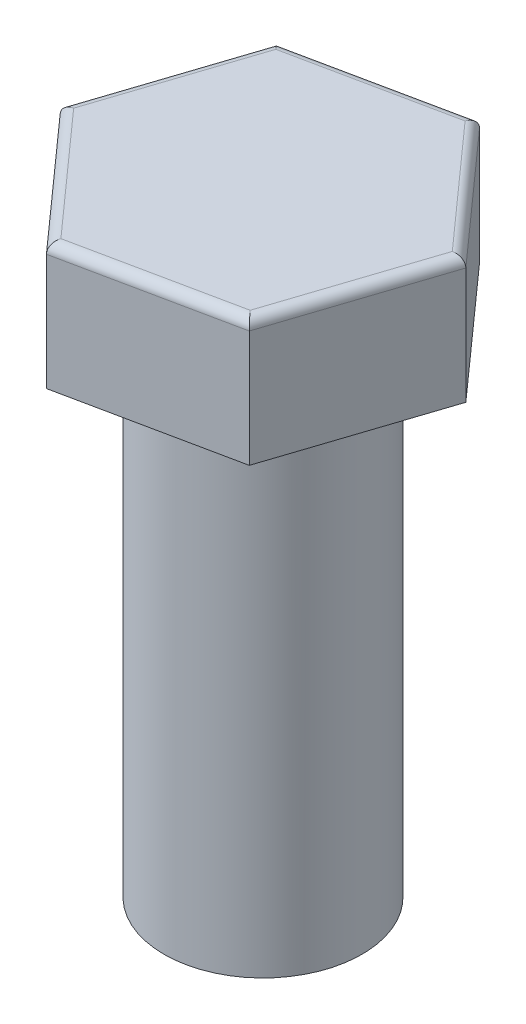
ISO-10303-21;
HEADER;
FILE_DESCRIPTION(('STEP AP214'),'2;1');
FILE_NAME('part.step','',(''),(''),'','','');
FILE_SCHEMA(('AUTOMOTIVE_DESIGN { 1 0 10303 214 1 1 1 1 }'));
ENDSEC;
DATA;
#1=APPLICATION_CONTEXT('core data for automotive mechanical design processes');
#2=APPLICATION_PROTOCOL_DEFINITION('international standard','automotive_design',2000,#1);
#3=PRODUCT_CONTEXT('',#1,'mechanical');
#4=PRODUCT('Part','Part','',(#3));
#5=PRODUCT_RELATED_PRODUCT_CATEGORY('part','',(#4));
#6=PRODUCT_DEFINITION_FORMATION('','',#4);
#7=PRODUCT_DEFINITION_CONTEXT('part definition',#1,'design');
#8=PRODUCT_DEFINITION('design','',#6,#7);
#9=PRODUCT_DEFINITION_SHAPE('','',#8);
#10=(LENGTH_UNIT() NAMED_UNIT(*) SI_UNIT(.MILLI.,.METRE.));
#11=(NAMED_UNIT(*) PLANE_ANGLE_UNIT() SI_UNIT($,.RADIAN.));
#12=(NAMED_UNIT(*) SI_UNIT($,.STERADIAN.) SOLID_ANGLE_UNIT());
#13=UNCERTAINTY_MEASURE_WITH_UNIT(LENGTH_MEASURE(1.E-05),#10,'distance_accuracy_value','');
#14=(GEOMETRIC_REPRESENTATION_CONTEXT(3) GLOBAL_UNCERTAINTY_ASSIGNED_CONTEXT((#13)) GLOBAL_UNIT_ASSIGNED_CONTEXT((#10,
#11,#12)) REPRESENTATION_CONTEXT('',''));
#15=CARTESIAN_POINT('',(0.,0.,0.));
#16=DIRECTION('',(0.,0.,1.));
#17=DIRECTION('',(1.,0.,0.));
#18=AXIS2_PLACEMENT_3D('',#15,#16,#17);
#19=CARTESIAN_POINT('',(6.9214389065101,0.,7.75201157529116));
#20=DIRECTION('',(0.,1.,0.));
#21=DIRECTION('',(0.,0.,1.));
#22=AXIS2_PLACEMENT_3D('',#19,#20,#21);
#23=PLANE('',#22);
#24=DIRECTION('',(0.979008849262027,0.,-0.203817744729554));
#25=VECTOR('',#24,1.);
#26=CARTESIAN_POINT('',(-3.25271950137811,0.,9.8701477114253));
#27=LINE('',#26,#25);
#28=CARTESIAN_POINT('',(-3.25271950137811,0.,9.8701477114253));
#29=VERTEX_POINT('',#28);
#30=CARTESIAN_POINT('',(6.9214389065101,0.,7.75201157529116));
#31=VERTEX_POINT('',#30);
#32=EDGE_CURVE('E122',#29,#31,#27,.T.);
#33=ORIENTED_EDGE('',*,*,#32,.F.);
#34=DIRECTION('',(0.666015769308859,0.,0.745937661625908));
#35=VECTOR('',#34,1.);
#36=CARTESIAN_POINT('',(-10.1741584078882,0.,2.11813613613414));
#37=LINE('',#36,#35);
#38=CARTESIAN_POINT('',(-10.1741584078882,0.,2.11813613613414));
#39=VERTEX_POINT('',#38);
#40=EDGE_CURVE('E142',#39,#29,#37,.T.);
#41=ORIENTED_EDGE('',*,*,#40,.F.);
#42=DIRECTION('',(-0.312993079953168,0.,0.949755406355463));
#43=VECTOR('',#42,1.);
#44=CARTESIAN_POINT('',(-6.92143890651008,0.,-7.75201157529115));
#45=LINE('',#44,#43);
#46=CARTESIAN_POINT('',(-6.92143890651008,0.,-7.75201157529115));
#47=VERTEX_POINT('',#46);
#48=EDGE_CURVE('E139',#47,#39,#45,.T.);
#49=ORIENTED_EDGE('',*,*,#48,.F.);
#50=DIRECTION('',(-0.979008849262027,0.,0.203817744729554));
#51=VECTOR('',#50,1.);
#52=CARTESIAN_POINT('',(3.25271950137813,0.,-9.8701477114253));
#53=LINE('',#52,#51);
#54=CARTESIAN_POINT('',(3.25271950137813,0.,-9.8701477114253));
#55=VERTEX_POINT('',#54);
#56=EDGE_CURVE('E136',#55,#47,#53,.T.);
#57=ORIENTED_EDGE('',*,*,#56,.F.);
#58=DIRECTION('',(-0.666015769308859,0.,-0.745937661625908));
#59=VECTOR('',#58,1.);
#60=CARTESIAN_POINT('',(10.1741584078882,0.,-2.11813613613415));
#61=LINE('',#60,#59);
#62=CARTESIAN_POINT('',(10.1741584078882,0.,-2.11813613613415));
#63=VERTEX_POINT('',#62);
#64=EDGE_CURVE('E125',#63,#55,#61,.T.);
#65=ORIENTED_EDGE('',*,*,#64,.F.);
#66=DIRECTION('',(0.312993079953167,0.,-0.949755406355463));
#67=VECTOR('',#66,1.);
#68=CARTESIAN_POINT('',(6.9214389065101,0.,7.75201157529116));
#69=LINE('',#68,#67);
#70=EDGE_CURVE('E110',#31,#63,#69,.T.);
#71=ORIENTED_EDGE('',*,*,#70,.F.);
#72=EDGE_LOOP('',(#33,#41,#49,#57,#65,#71));
#73=FACE_BOUND('',#72,.T.);
#74=CARTESIAN_POINT('',(0.,0.,0.));
#75=DIRECTION('',(0.,1.,0.));
#76=DIRECTION('',(0.,0.,1.));
#77=AXIS2_PLACEMENT_3D('',#74,#75,#76);
#78=CIRCLE('',#77,6.);
#79=CARTESIAN_POINT('',(0.,0.,6.));
#80=VERTEX_POINT('',#79);
#81=EDGE_CURVE('E115',#80,#80,#78,.F.);
#82=ORIENTED_EDGE('',*,*,#81,.F.);
#83=EDGE_LOOP('',(#82));
#84=FACE_BOUND('',#83,.T.);
#85=ADVANCED_FACE('F35',(#73,#84),#23,.F.);
#86=CARTESIAN_POINT('',(-3.25271950137811,7.65,9.8701477114253));
#87=DIRECTION('',(-0.203817744729554,0.,-0.979008849262027));
#88=DIRECTION('',(-0.979008849262027,0.,0.203817744729554));
#89=AXIS2_PLACEMENT_3D('',#86,#87,#88);
#90=PLANE('',#89);
#91=DIRECTION('',(0.,-1.,0.));
#92=VECTOR('',#91,1.);
#93=CARTESIAN_POINT('',(6.9214389065101,7.65,7.75201157529116));
#94=LINE('',#93,#92);
#95=CARTESIAN_POINT('',(6.9214389065101,7.05,7.75201157529116));
#96=VERTEX_POINT('',#95);
#97=EDGE_CURVE('E106',#96,#31,#94,.T.);
#98=ORIENTED_EDGE('',*,*,#97,.F.);
#99=DIRECTION('',(0.979008849262027,0.,-0.203817744729554));
#100=VECTOR('',#99,1.);
#101=CARTESIAN_POINT('',(-3.25271950137811,7.05,9.8701477114253));
#102=LINE('',#101,#100);
#103=CARTESIAN_POINT('',(-3.25271950137811,7.05,9.8701477114253));
#104=VERTEX_POINT('',#103);
#105=EDGE_CURVE('E59',#96,#104,#102,.F.);
#106=ORIENTED_EDGE('',*,*,#105,.T.);
#107=DIRECTION('',(0.,-1.,0.));
#108=VECTOR('',#107,1.);
#109=CARTESIAN_POINT('',(-3.25271950137811,7.65,9.8701477114253));
#110=LINE('',#109,#108);
#111=EDGE_CURVE('E128',#104,#29,#110,.T.);
#112=ORIENTED_EDGE('',*,*,#111,.T.);
#113=ORIENTED_EDGE('',*,*,#32,.T.);
#114=EDGE_LOOP('',(#98,#106,#112,#113));
#115=FACE_BOUND('',#114,.T.);
#116=ADVANCED_FACE('F127',(#115),#90,.F.);
#117=CARTESIAN_POINT('',(6.9214389065101,7.65,7.75201157529116));
#118=DIRECTION('',(-0.949755406355463,0.,-0.312993079953167));
#119=DIRECTION('',(-0.312993079953167,0.,0.949755406355463));
#120=AXIS2_PLACEMENT_3D('',#117,#118,#119);
#121=PLANE('',#120);
#122=DIRECTION('',(0.,-1.,0.));
#123=VECTOR('',#122,1.);
#124=CARTESIAN_POINT('',(10.1741584078882,7.65,-2.11813613613415));
#125=LINE('',#124,#123);
#126=CARTESIAN_POINT('',(10.1741584078882,7.05,-2.11813613613415));
#127=VERTEX_POINT('',#126);
#128=EDGE_CURVE('E116',#127,#63,#125,.T.);
#129=ORIENTED_EDGE('',*,*,#128,.F.);
#130=DIRECTION('',(0.312993079953167,0.,-0.949755406355463));
#131=VECTOR('',#130,1.);
#132=CARTESIAN_POINT('',(6.9214389065101,7.05,7.75201157529116));
#133=LINE('',#132,#131);
#134=EDGE_CURVE('E113',#127,#96,#133,.F.);
#135=ORIENTED_EDGE('',*,*,#134,.T.);
#136=ORIENTED_EDGE('',*,*,#97,.T.);
#137=ORIENTED_EDGE('',*,*,#70,.T.);
#138=EDGE_LOOP('',(#129,#135,#136,#137));
#139=FACE_BOUND('',#138,.T.);
#140=ADVANCED_FACE('F109',(#139),#121,.F.);
#141=CARTESIAN_POINT('',(10.1741584078882,7.65,-2.11813613613415));
#142=DIRECTION('',(-0.745937661625908,0.,0.666015769308859));
#143=DIRECTION('',(0.666015769308859,0.,0.745937661625909));
#144=AXIS2_PLACEMENT_3D('',#141,#142,#143);
#145=PLANE('',#144);
#146=DIRECTION('',(0.,-1.,0.));
#147=VECTOR('',#146,1.);
#148=CARTESIAN_POINT('',(3.25271950137813,7.65,-9.8701477114253));
#149=LINE('',#148,#147);
#150=CARTESIAN_POINT('',(3.25271950137813,7.05,-9.8701477114253));
#151=VERTEX_POINT('',#150);
#152=EDGE_CURVE('E149',#151,#55,#149,.T.);
#153=ORIENTED_EDGE('',*,*,#152,.F.);
#154=DIRECTION('',(-0.666015769308859,0.,-0.745937661625909));
#155=VECTOR('',#154,1.);
#156=CARTESIAN_POINT('',(10.1741584078882,7.05,-2.11813613613415));
#157=LINE('',#156,#155);
#158=EDGE_CURVE('E170',#151,#127,#157,.F.);
#159=ORIENTED_EDGE('',*,*,#158,.T.);
#160=ORIENTED_EDGE('',*,*,#128,.T.);
#161=ORIENTED_EDGE('',*,*,#64,.T.);
#162=EDGE_LOOP('',(#153,#159,#160,#161));
#163=FACE_BOUND('',#162,.T.);
#164=ADVANCED_FACE('F221',(#163),#145,.F.);
#165=CARTESIAN_POINT('',(3.25271950137813,7.65,-9.8701477114253));
#166=DIRECTION('',(0.203817744729554,0.,0.979008849262027));
#167=DIRECTION('',(0.979008849262027,0.,-0.203817744729554));
#168=AXIS2_PLACEMENT_3D('',#165,#166,#167);
#169=PLANE('',#168);
#170=DIRECTION('',(0.,-1.,0.));
#171=VECTOR('',#170,1.);
#172=CARTESIAN_POINT('',(-6.92143890651008,7.65,-7.75201157529115));
#173=LINE('',#172,#171);
#174=CARTESIAN_POINT('',(-6.92143890651008,7.05,-7.75201157529115));
#175=VERTEX_POINT('',#174);
#176=EDGE_CURVE('E147',#175,#47,#173,.T.);
#177=ORIENTED_EDGE('',*,*,#176,.F.);
#178=DIRECTION('',(-0.979008849262027,0.,0.203817744729554));
#179=VECTOR('',#178,1.);
#180=CARTESIAN_POINT('',(3.25271950137813,7.05,-9.8701477114253));
#181=LINE('',#180,#179);
#182=EDGE_CURVE('E167',#175,#151,#181,.F.);
#183=ORIENTED_EDGE('',*,*,#182,.T.);
#184=ORIENTED_EDGE('',*,*,#152,.T.);
#185=ORIENTED_EDGE('',*,*,#56,.T.);
#186=EDGE_LOOP('',(#177,#183,#184,#185));
#187=FACE_BOUND('',#186,.T.);
#188=ADVANCED_FACE('F209',(#187),#169,.F.);
#189=CARTESIAN_POINT('',(-6.92143890651008,7.65,-7.75201157529115));
#190=DIRECTION('',(0.949755406355463,0.,0.312993079953168));
#191=DIRECTION('',(0.312993079953168,0.,-0.949755406355463));
#192=AXIS2_PLACEMENT_3D('',#189,#190,#191);
#193=PLANE('',#192);
#194=DIRECTION('',(0.,-1.,0.));
#195=VECTOR('',#194,1.);
#196=CARTESIAN_POINT('',(-10.1741584078882,7.65,2.11813613613414));
#197=LINE('',#196,#195);
#198=CARTESIAN_POINT('',(-10.1741584078882,7.05,2.11813613613414));
#199=VERTEX_POINT('',#198);
#200=EDGE_CURVE('E145',#199,#39,#197,.T.);
#201=ORIENTED_EDGE('',*,*,#200,.F.);
#202=DIRECTION('',(-0.312993079953168,0.,0.949755406355463));
#203=VECTOR('',#202,1.);
#204=CARTESIAN_POINT('',(-6.92143890651008,7.05,-7.75201157529116));
#205=LINE('',#204,#203);
#206=EDGE_CURVE('E11',#199,#175,#205,.F.);
#207=ORIENTED_EDGE('',*,*,#206,.T.);
#208=ORIENTED_EDGE('',*,*,#176,.T.);
#209=ORIENTED_EDGE('',*,*,#48,.T.);
#210=EDGE_LOOP('',(#201,#207,#208,#209));
#211=FACE_BOUND('',#210,.T.);
#212=ADVANCED_FACE('F206',(#211),#193,.F.);
#213=CARTESIAN_POINT('',(-10.1741584078882,7.65,2.11813613613414));
#214=DIRECTION('',(0.745937661625908,0.,-0.66601576930886));
#215=DIRECTION('',(-0.66601576930886,0.,-0.745937661625908));
#216=AXIS2_PLACEMENT_3D('',#213,#214,#215);
#217=PLANE('',#216);
#218=ORIENTED_EDGE('',*,*,#111,.F.);
#219=DIRECTION('',(0.66601576930886,0.,0.745937661625908));
#220=VECTOR('',#219,1.);
#221=CARTESIAN_POINT('',(-10.1741584078882,7.05,2.11813613613414));
#222=LINE('',#221,#220);
#223=EDGE_CURVE('E44',#104,#199,#222,.F.);
#224=ORIENTED_EDGE('',*,*,#223,.T.);
#225=ORIENTED_EDGE('',*,*,#200,.T.);
#226=ORIENTED_EDGE('',*,*,#40,.T.);
#227=EDGE_LOOP('',(#218,#224,#225,#226));
#228=FACE_BOUND('',#227,.T.);
#229=ADVANCED_FACE('F222',(#228),#217,.F.);
#230=CARTESIAN_POINT('',(6.9214389065101,7.65,7.75201157529116));
#231=DIRECTION('',(0.,1.,0.));
#232=DIRECTION('',(0.,0.,1.));
#233=AXIS2_PLACEMENT_3D('',#230,#231,#232);
#234=PLANE('',#233);
#235=DIRECTION('',(-0.666015769308859,0.,-0.745937661625909));
#236=VECTOR('',#235,1.);
#237=CARTESIAN_POINT('',(2.80515690440258,7.65,-9.47053824983998));
#238=LINE('',#237,#236);
#239=CARTESIAN_POINT('',(9.49588118069566,7.65,-1.97692706039187));
#240=VERTEX_POINT('',#239);
#241=CARTESIAN_POINT('',(3.03587153461958,7.65,-9.21213786399694));
#242=VERTEX_POINT('',#241);
#243=EDGE_CURVE('E162',#240,#242,#238,.T.);
#244=ORIENTED_EDGE('',*,*,#243,.T.);
#245=DIRECTION('',(-0.979008849262027,0.,0.203817744729554));
#246=VECTOR('',#245,1.);
#247=CARTESIAN_POINT('',(-6.79914825967235,7.65,-7.16460626573394));
#248=LINE('',#247,#246);
#249=CARTESIAN_POINT('',(-6.46000964607608,7.65,-7.23521080360508));
#250=VERTEX_POINT('',#249);
#251=EDGE_CURVE('E164',#242,#250,#248,.T.);
#252=ORIENTED_EDGE('',*,*,#251,.T.);
#253=DIRECTION('',(-0.312993079953168,0.,0.949755406355463));
#254=VECTOR('',#253,1.);
#255=CARTESIAN_POINT('',(-9.60430516407493,7.65,2.30593198410604));
#256=LINE('',#255,#254);
#257=CARTESIAN_POINT('',(-9.49588118069566,7.65,1.97692706039186));
#258=VERTEX_POINT('',#257);
#259=EDGE_CURVE('E154',#250,#258,#256,.T.);
#260=ORIENTED_EDGE('',*,*,#259,.T.);
#261=DIRECTION('',(0.66601576930886,0.,0.745937661625908));
#262=VECTOR('',#261,1.);
#263=CARTESIAN_POINT('',(-2.80515690440256,7.65,9.47053824983998));
#264=LINE('',#263,#262);
#265=CARTESIAN_POINT('',(-3.03587153461957,7.65,9.21213786399695));
#266=VERTEX_POINT('',#265);
#267=EDGE_CURVE('E156',#258,#266,#264,.T.);
#268=ORIENTED_EDGE('',*,*,#267,.T.);
#269=DIRECTION('',(0.979008849262027,0.,-0.203817744729554));
#270=VECTOR('',#269,1.);
#271=CARTESIAN_POINT('',(6.79914825967237,7.65,7.16460626573394));
#272=LINE('',#271,#270);
#273=CARTESIAN_POINT('',(6.46000964607609,7.65,7.23521080360508));
#274=VERTEX_POINT('',#273);
#275=EDGE_CURVE('E158',#266,#274,#272,.T.);
#276=ORIENTED_EDGE('',*,*,#275,.T.);
#277=DIRECTION('',(0.312993079953167,0.,-0.949755406355463));
#278=VECTOR('',#277,1.);
#279=CARTESIAN_POINT('',(9.60430516407493,7.65,-2.30593198410605));
#280=LINE('',#279,#278);
#281=EDGE_CURVE('E160',#274,#240,#280,.T.);
#282=ORIENTED_EDGE('',*,*,#281,.T.);
#283=EDGE_LOOP('',(#244,#252,#260,#268,#276,#282));
#284=FACE_BOUND('',#283,.T.);
#285=ADVANCED_FACE('F224',(#284),#234,.T.);
#286=CARTESIAN_POINT('',(0.,-30.,0.));
#287=DIRECTION('',(0.,1.,0.));
#288=DIRECTION('',(0.,0.,1.));
#289=AXIS2_PLACEMENT_3D('',#286,#287,#288);
#290=CYLINDRICAL_SURFACE('',#289,6.);
#291=CARTESIAN_POINT('',(0.,-30.,0.));
#292=DIRECTION('',(0.,-1.,0.));
#293=DIRECTION('',(0.,0.,-1.));
#294=AXIS2_PLACEMENT_3D('',#291,#292,#293);
#295=CIRCLE('',#294,6.);
#296=CARTESIAN_POINT('',(0.,-30.,-6.));
#297=VERTEX_POINT('',#296);
#298=EDGE_CURVE('E130',#297,#297,#295,.T.);
#299=ORIENTED_EDGE('',*,*,#298,.F.);
#300=EDGE_LOOP('',(#299));
#301=FACE_BOUND('',#300,.T.);
#302=ORIENTED_EDGE('',*,*,#81,.T.);
#303=EDGE_LOOP('',(#302));
#304=FACE_BOUND('',#303,.T.);
#305=ADVANCED_FACE('F230',(#301,#304),#290,.T.);
#306=CARTESIAN_POINT('',(0.,-30.,0.));
#307=DIRECTION('',(0.,-1.,0.));
#308=DIRECTION('',(0.,0.,-1.));
#309=AXIS2_PLACEMENT_3D('',#306,#307,#308);
#310=PLANE('',#309);
#311=ORIENTED_EDGE('',*,*,#298,.T.);
#312=EDGE_LOOP('',(#311));
#313=FACE_BOUND('',#312,.T.);
#314=ADVANCED_FACE('F243',(#313),#310,.T.);
#315=CARTESIAN_POINT('',(6.79914825967237,7.05,7.16460626573394));
#316=DIRECTION('',(-0.979008849262027,0.,0.203817744729554));
#317=DIRECTION('',(0.203817744729554,0.,0.979008849262027));
#318=AXIS2_PLACEMENT_3D('',#315,#316,#317);
#319=CYLINDRICAL_SURFACE('',#318,0.6);
#320=CARTESIAN_POINT('',(-3.03587153461957,7.05,9.21213786399695));
#321=DIRECTION('',(-0.949755406355463,0.,-0.312993079953168));
#322=DIRECTION('',(0.312993079953168,0.,-0.949755406355463));
#323=AXIS2_PLACEMENT_3D('',#320,#321,#322);
#324=ELLIPSE('',#323,0.692820323027551,0.6);
#325=EDGE_CURVE('E184',#104,#266,#324,.T.);
#326=ORIENTED_EDGE('',*,*,#325,.F.);
#327=ORIENTED_EDGE('',*,*,#105,.F.);
#328=CARTESIAN_POINT('',(6.46000964607609,7.05,7.23521080360508));
#329=DIRECTION('',(-0.745937661625908,0.,0.66601576930886));
#330=DIRECTION('',(-0.66601576930886,0.,-0.745937661625908));
#331=AXIS2_PLACEMENT_3D('',#328,#329,#330);
#332=ELLIPSE('',#331,0.692820323027551,0.6);
#333=EDGE_CURVE('E39',#274,#96,#332,.F.);
#334=ORIENTED_EDGE('',*,*,#333,.F.);
#335=ORIENTED_EDGE('',*,*,#275,.F.);
#336=EDGE_LOOP('',(#326,#327,#334,#335));
#337=FACE_BOUND('',#336,.T.);
#338=ADVANCED_FACE('F37',(#337),#319,.T.);
#339=CARTESIAN_POINT('',(6.35158566269682,7.05,7.56421572731926));
#340=DIRECTION('',(-0.312993079953167,0.,0.949755406355463));
#341=DIRECTION('',(0.949755406355463,0.,0.312993079953167));
#342=AXIS2_PLACEMENT_3D('',#339,#340,#341);
#343=CYLINDRICAL_SURFACE('',#342,0.6);
#344=ORIENTED_EDGE('',*,*,#333,.T.);
#345=ORIENTED_EDGE('',*,*,#134,.F.);
#346=CARTESIAN_POINT('',(9.49588118069566,7.05,-1.97692706039187));
#347=DIRECTION('',(0.203817744729555,0.,0.979008849262027));
#348=DIRECTION('',(-0.979008849262027,0.,0.203817744729555));
#349=AXIS2_PLACEMENT_3D('',#346,#347,#348);
#350=ELLIPSE('',#349,0.692820323027551,0.6);
#351=EDGE_CURVE('E182',#240,#127,#350,.F.);
#352=ORIENTED_EDGE('',*,*,#351,.F.);
#353=ORIENTED_EDGE('',*,*,#281,.F.);
#354=EDGE_LOOP('',(#344,#345,#352,#353));
#355=FACE_BOUND('',#354,.T.);
#356=ADVANCED_FACE('F193',(#355),#343,.T.);
#357=CARTESIAN_POINT('',(0.655562548852483,7.05,13.3465440374856));
#358=DIRECTION('',(-0.66601576930886,0.,-0.745937661625908));
#359=DIRECTION('',(-0.745937661625908,0.,0.66601576930886));
#360=AXIS2_PLACEMENT_3D('',#357,#358,#359);
#361=CYLINDRICAL_SURFACE('',#360,0.6);
#362=ORIENTED_EDGE('',*,*,#325,.T.);
#363=ORIENTED_EDGE('',*,*,#267,.F.);
#364=CARTESIAN_POINT('',(-9.49588118069566,7.05,1.97692706039186));
#365=DIRECTION('',(-0.203817744729554,0.,-0.979008849262027));
#366=DIRECTION('',(0.979008849262027,0.,-0.203817744729554));
#367=AXIS2_PLACEMENT_3D('',#364,#365,#366);
#368=ELLIPSE('',#367,0.692820323027551,0.6);
#369=EDGE_CURVE('E179',#199,#258,#368,.T.);
#370=ORIENTED_EDGE('',*,*,#369,.F.);
#371=ORIENTED_EDGE('',*,*,#223,.F.);
#372=EDGE_LOOP('',(#362,#363,#370,#371));
#373=FACE_BOUND('',#372,.T.);
#374=ADVANCED_FACE('F198',(#373),#361,.T.);
#375=CARTESIAN_POINT('',(13.1873152641677,7.05,2.15747911309675));
#376=DIRECTION('',(0.666015769308859,0.,0.745937661625909));
#377=DIRECTION('',(0.745937661625909,0.,-0.666015769308859));
#378=AXIS2_PLACEMENT_3D('',#375,#376,#377);
#379=CYLINDRICAL_SURFACE('',#378,0.6);
#380=ORIENTED_EDGE('',*,*,#351,.T.);
#381=ORIENTED_EDGE('',*,*,#158,.F.);
#382=CARTESIAN_POINT('',(3.03587153461959,7.05,-9.21213786399694));
#383=DIRECTION('',(0.949755406355463,0.,0.312993079953168));
#384=DIRECTION('',(-0.312993079953168,0.,0.949755406355463));
#385=AXIS2_PLACEMENT_3D('',#382,#383,#384);
#386=ELLIPSE('',#385,0.692820323027551,0.6);
#387=EDGE_CURVE('E177',#242,#151,#386,.F.);
#388=ORIENTED_EDGE('',*,*,#387,.F.);
#389=ORIENTED_EDGE('',*,*,#243,.F.);
#390=EDGE_LOOP('',(#380,#381,#388,#389));
#391=FACE_BOUND('',#390,.T.);
#392=ADVANCED_FACE('F219',(#391),#379,.T.);
#393=CARTESIAN_POINT('',(-9.60430516407493,7.05,2.30593198410605));
#394=DIRECTION('',(0.312993079953168,0.,-0.949755406355463));
#395=DIRECTION('',(-0.949755406355463,0.,-0.312993079953168));
#396=AXIS2_PLACEMENT_3D('',#393,#394,#395);
#397=CYLINDRICAL_SURFACE('',#396,0.6);
#398=ORIENTED_EDGE('',*,*,#369,.T.);
#399=ORIENTED_EDGE('',*,*,#259,.F.);
#400=CARTESIAN_POINT('',(-6.46000964607608,7.05,-7.23521080360507));
#401=DIRECTION('',(0.745937661625909,0.,-0.666015769308859));
#402=DIRECTION('',(-0.666015769308859,0.,-0.745937661625909));
#403=AXIS2_PLACEMENT_3D('',#400,#401,#402);
#404=ELLIPSE('',#403,0.692820323027551,0.6);
#405=EDGE_CURVE('E175',#175,#250,#404,.T.);
#406=ORIENTED_EDGE('',*,*,#405,.F.);
#407=ORIENTED_EDGE('',*,*,#206,.F.);
#408=EDGE_LOOP('',(#398,#399,#406,#407));
#409=FACE_BOUND('',#408,.T.);
#410=ADVANCED_FACE('F203',(#409),#397,.T.);
#411=CARTESIAN_POINT('',(3.37501014821587,7.05,-9.28274240186808));
#412=DIRECTION('',(0.979008849262027,0.,-0.203817744729554));
#413=DIRECTION('',(-0.203817744729554,0.,-0.979008849262027));
#414=AXIS2_PLACEMENT_3D('',#411,#412,#413);
#415=CYLINDRICAL_SURFACE('',#414,0.6);
#416=ORIENTED_EDGE('',*,*,#387,.T.);
#417=ORIENTED_EDGE('',*,*,#182,.F.);
#418=ORIENTED_EDGE('',*,*,#405,.T.);
#419=ORIENTED_EDGE('',*,*,#251,.F.);
#420=EDGE_LOOP('',(#416,#417,#418,#419));
#421=FACE_BOUND('',#420,.T.);
#422=ADVANCED_FACE('F213',(#421),#415,.T.);
#423=CLOSED_SHELL('',(#85,#116,#140,#164,#188,#212,#229,#285,#305,#314,#338,#356,#374,#392,#410,#422));
#424=MANIFOLD_SOLID_BREP('B2',#423);
#425=ADVANCED_BREP_SHAPE_REPRESENTATION('',(#18,#424),#14);
#426=SHAPE_DEFINITION_REPRESENTATION(#9,#425);
ENDSEC;
END-ISO-10303-21;
